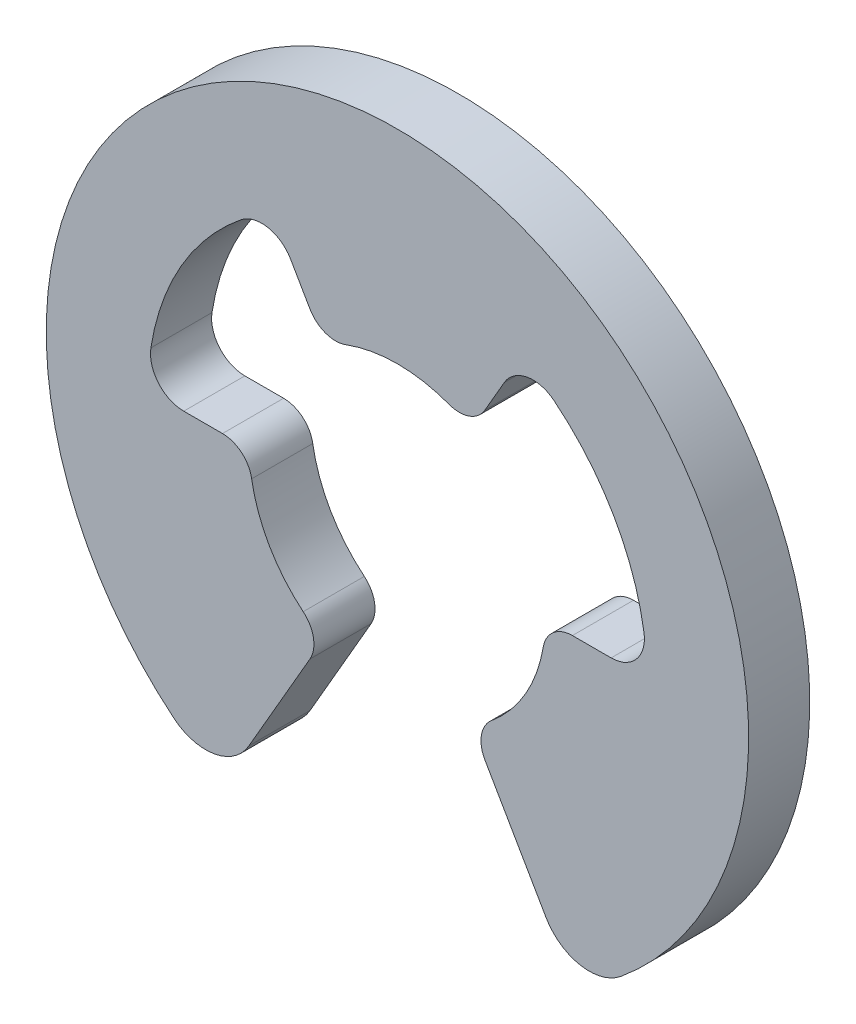
ISO-10303-21;
HEADER;
FILE_DESCRIPTION(('STEP AP214'),'2;1');
FILE_NAME('part.step','',(''),(''),'','','');
FILE_SCHEMA(('AUTOMOTIVE_DESIGN { 1 0 10303 214 1 1 1 1 }'));
ENDSEC;
DATA;
#1=APPLICATION_CONTEXT('core data for automotive mechanical design processes');
#2=APPLICATION_PROTOCOL_DEFINITION('international standard','automotive_design',2000,#1);
#3=PRODUCT_CONTEXT('',#1,'mechanical');
#4=PRODUCT('Part','Part','',(#3));
#5=PRODUCT_RELATED_PRODUCT_CATEGORY('part','',(#4));
#6=PRODUCT_DEFINITION_FORMATION('','',#4);
#7=PRODUCT_DEFINITION_CONTEXT('part definition',#1,'design');
#8=PRODUCT_DEFINITION('design','',#6,#7);
#9=PRODUCT_DEFINITION_SHAPE('','',#8);
#10=(LENGTH_UNIT() NAMED_UNIT(*) SI_UNIT(.MILLI.,.METRE.));
#11=(NAMED_UNIT(*) PLANE_ANGLE_UNIT() SI_UNIT($,.RADIAN.));
#12=(NAMED_UNIT(*) SI_UNIT($,.STERADIAN.) SOLID_ANGLE_UNIT());
#13=UNCERTAINTY_MEASURE_WITH_UNIT(LENGTH_MEASURE(1.E-05),#10,'distance_accuracy_value','');
#14=(GEOMETRIC_REPRESENTATION_CONTEXT(3) GLOBAL_UNCERTAINTY_ASSIGNED_CONTEXT((#13)) GLOBAL_UNIT_ASSIGNED_CONTEXT((#10,
#11,#12)) REPRESENTATION_CONTEXT('',''));
#15=CARTESIAN_POINT('',(0.,0.,0.));
#16=DIRECTION('',(0.,0.,1.));
#17=DIRECTION('',(1.,0.,0.));
#18=AXIS2_PLACEMENT_3D('',#15,#16,#17);
#19=CARTESIAN_POINT('',(3.4676526522127,-4.20148057663334,-0.55245));
#20=DIRECTION('',(0.,0.,1.));
#21=DIRECTION('',(1.,0.,0.));
#22=AXIS2_PLACEMENT_3D('',#19,#20,#21);
#23=PLANE('',#22);
#24=DIRECTION('',(-0.5,0.866025403784439,0.));
#25=VECTOR('',#24,1.);
#26=CARTESIAN_POINT('',(1.58157518881493,-2.73936858301781,-0.55245));
#27=LINE('',#26,#25);
#28=CARTESIAN_POINT('',(2.68620761948885,-4.65264807663335,-0.55245));
#29=VERTEX_POINT('',#28);
#30=CARTESIAN_POINT('',(1.58157518881493,-2.73936858301781,-0.55245));
#31=VERTEX_POINT('',#30);
#32=EDGE_CURVE('E178',#29,#31,#27,.T.);
#33=ORIENTED_EDGE('',*,*,#32,.T.);
#34=CARTESIAN_POINT('',(2.04461299145636,-2.47203358301781,-0.55245));
#35=DIRECTION('',(0.,0.,1.));
#36=DIRECTION('',(1.,0.,0.));
#37=AXIS2_PLACEMENT_3D('',#34,#35,#36);
#38=CIRCLE('',#37,0.53467);
#39=CARTESIAN_POINT('',(1.70384417243647,-2.0600279751873,-0.55245));
#40=VERTEX_POINT('',#39);
#41=EDGE_CURVE('E277',#40,#31,#38,.T.);
#42=ORIENTED_EDGE('',*,*,#41,.F.);
#43=CARTESIAN_POINT('',(0.,0.,-0.55245));
#44=DIRECTION('',(0.,0.,1.));
#45=DIRECTION('',(1.,0.,0.));
#46=AXIS2_PLACEMENT_3D('',#43,#44,#45);
#47=CIRCLE('',#46,2.67335);
#48=CARTESIAN_POINT('',(2.6359586471713,-0.445558338383286,-0.55245));
#49=VERTEX_POINT('',#48);
#50=EDGE_CURVE('E280',#40,#49,#47,.T.);
#51=ORIENTED_EDGE('',*,*,#50,.T.);
#52=CARTESIAN_POINT('',(3.16315037762987,-0.53467,-0.55245));
#53=DIRECTION('',(0.,0.,1.));
#54=DIRECTION('',(1.,0.,0.));
#55=AXIS2_PLACEMENT_3D('',#52,#53,#54);
#56=CIRCLE('',#55,0.53467);
#57=CARTESIAN_POINT('',(3.16315037762987,0.,-0.55245));
#58=VERTEX_POINT('',#57);
#59=EDGE_CURVE('E201',#58,#49,#56,.T.);
#60=ORIENTED_EDGE('',*,*,#59,.F.);
#61=DIRECTION('',(1.,0.,0.));
#62=VECTOR('',#61,1.);
#63=CARTESIAN_POINT('',(3.86356764628994,0.,-0.55245));
#64=LINE('',#63,#62);
#65=CARTESIAN_POINT('',(3.86356764628994,0.,-0.55245));
#66=VERTEX_POINT('',#65);
#67=EDGE_CURVE('E198',#58,#66,#64,.T.);
#68=ORIENTED_EDGE('',*,*,#67,.T.);
#69=CARTESIAN_POINT('',(3.86356764628994,0.601556666666666,-0.55245));
#70=DIRECTION('',(0.,0.,1.));
#71=DIRECTION('',(1.,0.,0.));
#72=AXIS2_PLACEMENT_3D('',#69,#70,#71);
#73=CIRCLE('',#72,0.601556666666666);
#74=CARTESIAN_POINT('',(4.45796266879608,0.694103846153846,-0.55245));
#75=VERTEX_POINT('',#74);
#76=EDGE_CURVE('E286',#66,#75,#73,.T.);
#77=ORIENTED_EDGE('',*,*,#76,.T.);
#78=CARTESIAN_POINT('',(0.,0.,-0.55245));
#79=DIRECTION('',(0.,0.,1.));
#80=DIRECTION('',(1.,0.,0.));
#81=AXIS2_PLACEMENT_3D('',#78,#79,#80);
#82=CIRCLE('',#81,4.511675);
#83=CARTESIAN_POINT('',(2.83009291463784,3.51365698384771,-0.55245));
#84=VERTEX_POINT('',#83);
#85=EDGE_CURVE('E290',#75,#84,#82,.T.);
#86=ORIENTED_EDGE('',*,*,#85,.T.);
#87=CARTESIAN_POINT('',(2.45274717829419,3.0451693975934,-0.55245));
#88=DIRECTION('',(0.,0.,1.));
#89=DIRECTION('',(1.,0.,0.));
#90=AXIS2_PLACEMENT_3D('',#87,#88,#89);
#91=CIRCLE('',#90,0.601556666666668);
#92=CARTESIAN_POINT('',(1.93178382314497,3.34594773092674,-0.55245));
#93=VERTEX_POINT('',#92);
#94=EDGE_CURVE('E294',#84,#93,#91,.T.);
#95=ORIENTED_EDGE('',*,*,#94,.T.);
#96=DIRECTION('',(-0.5,-0.866025403784439,0.));
#97=VECTOR('',#96,1.);
#98=CARTESIAN_POINT('',(1.58157518881494,2.73936858301781,-0.55245));
#99=LINE('',#98,#97);
#100=CARTESIAN_POINT('',(1.58157518881494,2.73936858301782,-0.55245));
#101=VERTEX_POINT('',#100);
#102=EDGE_CURVE('E203',#93,#101,#99,.T.);
#103=ORIENTED_EDGE('',*,*,#102,.T.);
#104=CARTESIAN_POINT('',(1.11853738617351,3.00670358301781,-0.55245));
#105=DIRECTION('',(0.,0.,1.));
#106=DIRECTION('',(1.,0.,0.));
#107=AXIS2_PLACEMENT_3D('',#104,#105,#106);
#108=CIRCLE('',#107,0.53467);
#109=CARTESIAN_POINT('',(0.932114472800587,2.50558632501371,-0.55245));
#110=VERTEX_POINT('',#109);
#111=EDGE_CURVE('E297',#110,#101,#108,.T.);
#112=ORIENTED_EDGE('',*,*,#111,.F.);
#113=CARTESIAN_POINT('',(0.,0.,-0.55245));
#114=DIRECTION('',(0.,0.,1.));
#115=DIRECTION('',(1.,0.,0.));
#116=AXIS2_PLACEMENT_3D('',#113,#114,#115);
#117=CIRCLE('',#116,2.67335);
#118=CARTESIAN_POINT('',(-0.932114488477924,2.50558631918151,-0.55245));
#119=VERTEX_POINT('',#118);
#120=EDGE_CURVE('E300',#110,#119,#117,.T.);
#121=ORIENTED_EDGE('',*,*,#120,.T.);
#122=CARTESIAN_POINT('',(-1.11853738617351,3.00670358301781,-0.55245));
#123=DIRECTION('',(0.,0.,1.));
#124=DIRECTION('',(1.,0.,0.));
#125=AXIS2_PLACEMENT_3D('',#122,#123,#124);
#126=CIRCLE('',#125,0.53467);
#127=CARTESIAN_POINT('',(-1.58157518881493,2.73936858301782,-0.55245));
#128=VERTEX_POINT('',#127);
#129=EDGE_CURVE('E211',#128,#119,#126,.T.);
#130=ORIENTED_EDGE('',*,*,#129,.F.);
#131=DIRECTION('',(-0.5,0.866025403784439,0.));
#132=VECTOR('',#131,1.);
#133=CARTESIAN_POINT('',(-1.93178382314496,3.34594773092674,-0.55245));
#134=LINE('',#133,#132);
#135=CARTESIAN_POINT('',(-1.93178382314496,3.34594773092674,-0.55245));
#136=VERTEX_POINT('',#135);
#137=EDGE_CURVE('E208',#128,#136,#134,.T.);
#138=ORIENTED_EDGE('',*,*,#137,.T.);
#139=CARTESIAN_POINT('',(-2.45274717829419,3.0451693975934,-0.55245));
#140=DIRECTION('',(0.,0.,1.));
#141=DIRECTION('',(1.,0.,0.));
#142=AXIS2_PLACEMENT_3D('',#139,#140,#141);
#143=CIRCLE('',#142,0.601556666666666);
#144=CARTESIAN_POINT('',(-2.83009289803176,3.51365699722315,-0.55245));
#145=VERTEX_POINT('',#144);
#146=EDGE_CURVE('E306',#136,#145,#143,.T.);
#147=ORIENTED_EDGE('',*,*,#146,.T.);
#148=CARTESIAN_POINT('',(0.,0.,-0.55245));
#149=DIRECTION('',(0.,0.,1.));
#150=DIRECTION('',(1.,0.,0.));
#151=AXIS2_PLACEMENT_3D('',#148,#149,#150);
#152=CIRCLE('',#151,4.511675);
#153=CARTESIAN_POINT('',(-4.45796266991038,0.694103838997061,-0.55245));
#154=VERTEX_POINT('',#153);
#155=EDGE_CURVE('E310',#145,#154,#152,.T.);
#156=ORIENTED_EDGE('',*,*,#155,.T.);
#157=CARTESIAN_POINT('',(-3.86356764628992,0.601556666666668,-0.55245));
#158=DIRECTION('',(0.,0.,1.));
#159=DIRECTION('',(1.,0.,0.));
#160=AXIS2_PLACEMENT_3D('',#157,#158,#159);
#161=CIRCLE('',#160,0.601556666666668);
#162=CARTESIAN_POINT('',(-3.86356764628993,0.,-0.55245));
#163=VERTEX_POINT('',#162);
#164=EDGE_CURVE('E314',#154,#163,#161,.T.);
#165=ORIENTED_EDGE('',*,*,#164,.T.);
#166=DIRECTION('',(1.,0.,0.));
#167=VECTOR('',#166,1.);
#168=CARTESIAN_POINT('',(-3.16315037762987,0.,-0.55245));
#169=LINE('',#168,#167);
#170=CARTESIAN_POINT('',(-3.16315037762987,0.,-0.55245));
#171=VERTEX_POINT('',#170);
#172=EDGE_CURVE('E213',#163,#171,#169,.T.);
#173=ORIENTED_EDGE('',*,*,#172,.T.);
#174=CARTESIAN_POINT('',(-3.16315037762987,-0.53467,-0.55245));
#175=DIRECTION('',(0.,0.,1.));
#176=DIRECTION('',(1.,0.,0.));
#177=AXIS2_PLACEMENT_3D('',#174,#175,#176);
#178=CIRCLE('',#177,0.53467);
#179=CARTESIAN_POINT('',(-2.63595864523706,-0.445558349826407,-0.55245));
#180=VERTEX_POINT('',#179);
#181=EDGE_CURVE('E317',#180,#171,#178,.T.);
#182=ORIENTED_EDGE('',*,*,#181,.F.);
#183=CARTESIAN_POINT('',(0.,0.,-0.55245));
#184=DIRECTION('',(0.,0.,1.));
#185=DIRECTION('',(1.,0.,0.));
#186=AXIS2_PLACEMENT_3D('',#183,#184,#185);
#187=CIRCLE('',#186,2.67335);
#188=CARTESIAN_POINT('',(-1.70384415560038,-2.06002798911239,-0.55245));
#189=VERTEX_POINT('',#188);
#190=EDGE_CURVE('E320',#180,#189,#187,.T.);
#191=ORIENTED_EDGE('',*,*,#190,.T.);
#192=CARTESIAN_POINT('',(-2.04461299145636,-2.47203358301781,-0.55245));
#193=DIRECTION('',(0.,0.,1.));
#194=DIRECTION('',(1.,0.,0.));
#195=AXIS2_PLACEMENT_3D('',#192,#193,#194);
#196=CIRCLE('',#195,0.53467);
#197=CARTESIAN_POINT('',(-1.58157518881494,-2.73936858301781,-0.55245));
#198=VERTEX_POINT('',#197);
#199=EDGE_CURVE('E221',#198,#189,#196,.T.);
#200=ORIENTED_EDGE('',*,*,#199,.F.);
#201=DIRECTION('',(-0.500000000000001,-0.866025403784438,0.));
#202=VECTOR('',#201,1.);
#203=CARTESIAN_POINT('',(-2.68620761948885,-4.65264807663334,-0.55245));
#204=LINE('',#203,#202);
#205=CARTESIAN_POINT('',(-2.68620761948885,-4.65264807663335,-0.55245));
#206=VERTEX_POINT('',#205);
#207=EDGE_CURVE('E218',#198,#206,#204,.T.);
#208=ORIENTED_EDGE('',*,*,#207,.T.);
#209=CARTESIAN_POINT('',(-3.4676526522127,-4.20148057663334,-0.55245));
#210=DIRECTION('',(0.,0.,1.));
#211=DIRECTION('',(1.,0.,0.));
#212=AXIS2_PLACEMENT_3D('',#209,#210,#211);
#213=CIRCLE('',#212,0.902335);
#214=CARTESIAN_POINT('',(-4.04202430611108,-4.89740130158917,-0.55245));
#215=VERTEX_POINT('',#214);
#216=EDGE_CURVE('E326',#215,#206,#213,.T.);
#217=ORIENTED_EDGE('',*,*,#216,.F.);
#218=CARTESIAN_POINT('',(0.,0.,-0.55245));
#219=DIRECTION('',(0.,0.,1.));
#220=DIRECTION('',(1.,0.,0.));
#221=AXIS2_PLACEMENT_3D('',#218,#219,#220);
#222=CIRCLE('',#221,6.35);
#223=CARTESIAN_POINT('',(4.0420243212384,-4.89740128910397,-0.55245));
#224=VERTEX_POINT('',#223);
#225=EDGE_CURVE('E180',#224,#215,#222,.T.);
#226=ORIENTED_EDGE('',*,*,#225,.F.);
#227=CARTESIAN_POINT('',(3.4676526522127,-4.20148057663334,-0.55245));
#228=DIRECTION('',(0.,0.,1.));
#229=DIRECTION('',(1.,0.,0.));
#230=AXIS2_PLACEMENT_3D('',#227,#228,#229);
#231=CIRCLE('',#230,0.902335);
#232=EDGE_CURVE('E20',#29,#224,#231,.T.);
#233=ORIENTED_EDGE('',*,*,#232,.F.);
#234=EDGE_LOOP('',(#33,#42,#51,#60,#68,#77,#86,#95,#103,#112,#121,#130,#138,#147,#156,#165,#173,
#182,#191,#200,#208,#217,#226,#233));
#235=FACE_BOUND('',#234,.T.);
#236=ADVANCED_FACE('F17',(#235),#23,.F.);
#237=CARTESIAN_POINT('',(3.4676526522127,-4.20148057663334,0.55245));
#238=DIRECTION('',(0.,0.,1.));
#239=DIRECTION('',(1.,0.,0.));
#240=AXIS2_PLACEMENT_3D('',#237,#238,#239);
#241=CYLINDRICAL_SURFACE('',#240,0.902335);
#242=CARTESIAN_POINT('',(3.4676526522127,-4.20148057663334,0.55245));
#243=DIRECTION('',(0.,0.,1.));
#244=DIRECTION('',(1.,0.,0.));
#245=AXIS2_PLACEMENT_3D('',#242,#243,#244);
#246=CIRCLE('',#245,0.902335);
#247=CARTESIAN_POINT('',(2.68620761948885,-4.65264807663335,0.55245));
#248=VERTEX_POINT('',#247);
#249=CARTESIAN_POINT('',(4.0420243212384,-4.89740128910397,0.55245));
#250=VERTEX_POINT('',#249);
#251=EDGE_CURVE('E187',#248,#250,#246,.T.);
#252=ORIENTED_EDGE('',*,*,#251,.F.);
#253=DIRECTION('',(0.,0.,1.));
#254=VECTOR('',#253,1.);
#255=CARTESIAN_POINT('',(2.68620761948885,-4.65264807663334,0.55245));
#256=LINE('',#255,#254);
#257=EDGE_CURVE('E184',#248,#29,#256,.F.);
#258=ORIENTED_EDGE('',*,*,#257,.T.);
#259=ORIENTED_EDGE('',*,*,#232,.T.);
#260=DIRECTION('',(0.,0.,1.));
#261=VECTOR('',#260,1.);
#262=CARTESIAN_POINT('',(4.04202433636572,-4.89740127661878,0.55245));
#263=LINE('',#262,#261);
#264=EDGE_CURVE('E196',#250,#224,#263,.F.);
#265=ORIENTED_EDGE('',*,*,#264,.F.);
#266=EDGE_LOOP('',(#252,#258,#259,#265));
#267=FACE_BOUND('',#266,.T.);
#268=ADVANCED_FACE('F185',(#267),#241,.T.);
#269=CARTESIAN_POINT('',(0.,0.,0.55245));
#270=DIRECTION('',(0.,0.,1.));
#271=DIRECTION('',(1.,0.,0.));
#272=AXIS2_PLACEMENT_3D('',#269,#270,#271);
#273=CYLINDRICAL_SURFACE('',#272,6.35);
#274=CARTESIAN_POINT('',(0.,0.,0.55245));
#275=DIRECTION('',(0.,0.,1.));
#276=DIRECTION('',(1.,0.,0.));
#277=AXIS2_PLACEMENT_3D('',#274,#275,#276);
#278=CIRCLE('',#277,6.35);
#279=CARTESIAN_POINT('',(-4.04202430611108,-4.89740130158917,0.55245));
#280=VERTEX_POINT('',#279);
#281=EDGE_CURVE('E192',#250,#280,#278,.T.);
#282=ORIENTED_EDGE('',*,*,#281,.F.);
#283=ORIENTED_EDGE('',*,*,#264,.T.);
#284=ORIENTED_EDGE('',*,*,#225,.T.);
#285=DIRECTION('',(0.,0.,1.));
#286=VECTOR('',#285,1.);
#287=CARTESIAN_POINT('',(-4.04202430611107,-4.89740130158917,0.55245));
#288=LINE('',#287,#286);
#289=EDGE_CURVE('E327',#280,#215,#288,.F.);
#290=ORIENTED_EDGE('',*,*,#289,.F.);
#291=EDGE_LOOP('',(#282,#283,#284,#290));
#292=FACE_BOUND('',#291,.T.);
#293=ADVANCED_FACE('F331',(#292),#273,.T.);
#294=CARTESIAN_POINT('',(-3.4676526522127,-4.20148057663334,0.55245));
#295=DIRECTION('',(0.,0.,1.));
#296=DIRECTION('',(1.,0.,0.));
#297=AXIS2_PLACEMENT_3D('',#294,#295,#296);
#298=CYLINDRICAL_SURFACE('',#297,0.902335);
#299=CARTESIAN_POINT('',(-3.4676526522127,-4.20148057663334,0.55245));
#300=DIRECTION('',(0.,0.,1.));
#301=DIRECTION('',(1.,0.,0.));
#302=AXIS2_PLACEMENT_3D('',#299,#300,#301);
#303=CIRCLE('',#302,0.902335);
#304=CARTESIAN_POINT('',(-2.68620761948885,-4.65264807663335,0.55245));
#305=VERTEX_POINT('',#304);
#306=EDGE_CURVE('E272',#280,#305,#303,.T.);
#307=ORIENTED_EDGE('',*,*,#306,.F.);
#308=ORIENTED_EDGE('',*,*,#289,.T.);
#309=ORIENTED_EDGE('',*,*,#216,.T.);
#310=DIRECTION('',(0.,0.,1.));
#311=VECTOR('',#310,1.);
#312=CARTESIAN_POINT('',(-2.68620761948885,-4.65264807663334,0.55245));
#313=LINE('',#312,#311);
#314=EDGE_CURVE('E222',#206,#305,#313,.T.);
#315=ORIENTED_EDGE('',*,*,#314,.T.);
#316=EDGE_LOOP('',(#307,#308,#309,#315));
#317=FACE_BOUND('',#316,.T.);
#318=ADVANCED_FACE('F367',(#317),#298,.T.);
#319=CARTESIAN_POINT('',(-2.68620761948885,-4.65264807663334,0.55245));
#320=DIRECTION('',(-0.866025403784438,0.500000000000001,0.));
#321=DIRECTION('',(-0.500000000000001,-0.866025403784438,0.));
#322=AXIS2_PLACEMENT_3D('',#319,#320,#321);
#323=PLANE('',#322);
#324=DIRECTION('',(0.,0.,1.));
#325=VECTOR('',#324,1.);
#326=CARTESIAN_POINT('',(-1.58157518881494,-2.73936858301781,0.55245));
#327=LINE('',#326,#325);
#328=CARTESIAN_POINT('',(-1.58157518881494,-2.73936858301781,0.55245));
#329=VERTEX_POINT('',#328);
#330=EDGE_CURVE('E325',#329,#198,#327,.F.);
#331=ORIENTED_EDGE('',*,*,#330,.F.);
#332=DIRECTION('',(0.499999999999999,0.866025403784439,0.));
#333=VECTOR('',#332,1.);
#334=CARTESIAN_POINT('',(-2.68620761948885,-4.65264807663334,0.55245));
#335=LINE('',#334,#333);
#336=EDGE_CURVE('E271',#305,#329,#335,.T.);
#337=ORIENTED_EDGE('',*,*,#336,.F.);
#338=ORIENTED_EDGE('',*,*,#314,.F.);
#339=ORIENTED_EDGE('',*,*,#207,.F.);
#340=EDGE_LOOP('',(#331,#337,#338,#339));
#341=FACE_BOUND('',#340,.T.);
#342=ADVANCED_FACE('F587',(#341),#323,.F.);
#343=CARTESIAN_POINT('',(-2.04461299145636,-2.47203358301781,0.55245));
#344=DIRECTION('',(0.,0.,1.));
#345=DIRECTION('',(1.,0.,0.));
#346=AXIS2_PLACEMENT_3D('',#343,#344,#345);
#347=CYLINDRICAL_SURFACE('',#346,0.53467);
#348=CARTESIAN_POINT('',(-2.04461299145636,-2.47203358301781,0.55245));
#349=DIRECTION('',(0.,0.,1.));
#350=DIRECTION('',(1.,0.,0.));
#351=AXIS2_PLACEMENT_3D('',#348,#349,#350);
#352=CIRCLE('',#351,0.53467);
#353=CARTESIAN_POINT('',(-1.70384415560038,-2.06002798911239,0.55245));
#354=VERTEX_POINT('',#353);
#355=EDGE_CURVE('E268',#329,#354,#352,.T.);
#356=ORIENTED_EDGE('',*,*,#355,.F.);
#357=ORIENTED_EDGE('',*,*,#330,.T.);
#358=ORIENTED_EDGE('',*,*,#199,.T.);
#359=DIRECTION('',(0.,0.,1.));
#360=VECTOR('',#359,1.);
#361=CARTESIAN_POINT('',(-1.70384415165379,-2.0600279923766,0.55245));
#362=LINE('',#361,#360);
#363=EDGE_CURVE('E323',#189,#354,#362,.T.);
#364=ORIENTED_EDGE('',*,*,#363,.T.);
#365=EDGE_LOOP('',(#356,#357,#358,#364));
#366=FACE_BOUND('',#365,.T.);
#367=ADVANCED_FACE('F577',(#366),#347,.T.);
#368=CARTESIAN_POINT('',(0.,0.,0.55245));
#369=DIRECTION('',(0.,0.,1.));
#370=DIRECTION('',(1.,0.,0.));
#371=AXIS2_PLACEMENT_3D('',#368,#369,#370);
#372=CYLINDRICAL_SURFACE('',#371,2.67335);
#373=DIRECTION('',(0.,0.,1.));
#374=VECTOR('',#373,1.);
#375=CARTESIAN_POINT('',(-2.63595864244922,-0.44555836631948,0.55245));
#376=LINE('',#375,#374);
#377=CARTESIAN_POINT('',(-2.63595864523706,-0.445558349826407,0.55245));
#378=VERTEX_POINT('',#377);
#379=EDGE_CURVE('E319',#378,#180,#376,.F.);
#380=ORIENTED_EDGE('',*,*,#379,.F.);
#381=CARTESIAN_POINT('',(0.,0.,0.55245));
#382=DIRECTION('',(0.,0.,1.));
#383=DIRECTION('',(1.,0.,0.));
#384=AXIS2_PLACEMENT_3D('',#381,#382,#383);
#385=CIRCLE('',#384,2.67335);
#386=EDGE_CURVE('E265',#354,#378,#385,.F.);
#387=ORIENTED_EDGE('',*,*,#386,.F.);
#388=ORIENTED_EDGE('',*,*,#363,.F.);
#389=ORIENTED_EDGE('',*,*,#190,.F.);
#390=EDGE_LOOP('',(#380,#387,#388,#389));
#391=FACE_BOUND('',#390,.T.);
#392=ADVANCED_FACE('F567',(#391),#372,.F.);
#393=CARTESIAN_POINT('',(-3.16315037762987,-0.53467,0.55245));
#394=DIRECTION('',(0.,0.,1.));
#395=DIRECTION('',(1.,0.,0.));
#396=AXIS2_PLACEMENT_3D('',#393,#394,#395);
#397=CYLINDRICAL_SURFACE('',#396,0.53467);
#398=CARTESIAN_POINT('',(-3.16315037762987,-0.53467,0.55245));
#399=DIRECTION('',(0.,0.,1.));
#400=DIRECTION('',(1.,0.,0.));
#401=AXIS2_PLACEMENT_3D('',#398,#399,#400);
#402=CIRCLE('',#401,0.53467);
#403=CARTESIAN_POINT('',(-3.16315037762987,0.,0.55245));
#404=VERTEX_POINT('',#403);
#405=EDGE_CURVE('E262',#378,#404,#402,.T.);
#406=ORIENTED_EDGE('',*,*,#405,.F.);
#407=ORIENTED_EDGE('',*,*,#379,.T.);
#408=ORIENTED_EDGE('',*,*,#181,.T.);
#409=DIRECTION('',(0.,0.,-1.));
#410=VECTOR('',#409,1.);
#411=CARTESIAN_POINT('',(-3.16315037762987,0.,0.55245));
#412=LINE('',#411,#410);
#413=EDGE_CURVE('E217',#171,#404,#412,.F.);
#414=ORIENTED_EDGE('',*,*,#413,.T.);
#415=EDGE_LOOP('',(#406,#407,#408,#414));
#416=FACE_BOUND('',#415,.T.);
#417=ADVANCED_FACE('F557',(#416),#397,.T.);
#418=CARTESIAN_POINT('',(-3.16315037762987,0.,0.55245));
#419=DIRECTION('',(0.,-1.,0.));
#420=DIRECTION('',(0.,0.,-1.));
#421=AXIS2_PLACEMENT_3D('',#418,#419,#420);
#422=PLANE('',#421);
#423=DIRECTION('',(0.,0.,1.));
#424=VECTOR('',#423,1.);
#425=CARTESIAN_POINT('',(-3.86356764628994,0.,0.55245));
#426=LINE('',#425,#424);
#427=CARTESIAN_POINT('',(-3.86356764628993,0.,0.55245));
#428=VERTEX_POINT('',#427);
#429=EDGE_CURVE('E216',#163,#428,#426,.T.);
#430=ORIENTED_EDGE('',*,*,#429,.T.);
#431=DIRECTION('',(1.,0.,0.));
#432=VECTOR('',#431,1.);
#433=CARTESIAN_POINT('',(3.4676526522127,0.,0.55245));
#434=LINE('',#433,#432);
#435=EDGE_CURVE('E261',#404,#428,#434,.F.);
#436=ORIENTED_EDGE('',*,*,#435,.F.);
#437=ORIENTED_EDGE('',*,*,#413,.F.);
#438=ORIENTED_EDGE('',*,*,#172,.F.);
#439=EDGE_LOOP('',(#430,#436,#437,#438));
#440=FACE_BOUND('',#439,.T.);
#441=ADVANCED_FACE('F547',(#440),#422,.F.);
#442=CARTESIAN_POINT('',(-3.86356764628992,0.601556666666668,0.55245));
#443=DIRECTION('',(0.,0.,1.));
#444=DIRECTION('',(1.,0.,0.));
#445=AXIS2_PLACEMENT_3D('',#442,#443,#444);
#446=CYLINDRICAL_SURFACE('',#445,0.601556666666668);
#447=DIRECTION('',(0.,0.,1.));
#448=VECTOR('',#447,1.);
#449=CARTESIAN_POINT('',(-4.4579626710247,0.694103831840273,0.55245));
#450=LINE('',#449,#448);
#451=CARTESIAN_POINT('',(-4.45796266991039,0.694103838997062,0.55245));
#452=VERTEX_POINT('',#451);
#453=EDGE_CURVE('E313',#154,#452,#450,.T.);
#454=ORIENTED_EDGE('',*,*,#453,.T.);
#455=CARTESIAN_POINT('',(-3.86356764628992,0.601556666666668,0.55245));
#456=DIRECTION('',(0.,0.,1.));
#457=DIRECTION('',(1.,0.,0.));
#458=AXIS2_PLACEMENT_3D('',#455,#456,#457);
#459=CIRCLE('',#458,0.601556666666668);
#460=EDGE_CURVE('E258',#428,#452,#459,.F.);
#461=ORIENTED_EDGE('',*,*,#460,.F.);
#462=ORIENTED_EDGE('',*,*,#429,.F.);
#463=ORIENTED_EDGE('',*,*,#164,.F.);
#464=EDGE_LOOP('',(#454,#461,#462,#463));
#465=FACE_BOUND('',#464,.T.);
#466=ADVANCED_FACE('F537',(#465),#446,.F.);
#467=CARTESIAN_POINT('',(0.,0.,0.55245));
#468=DIRECTION('',(0.,0.,1.));
#469=DIRECTION('',(1.,0.,0.));
#470=AXIS2_PLACEMENT_3D('',#467,#468,#469);
#471=CYLINDRICAL_SURFACE('',#470,4.511675);
#472=DIRECTION('',(0.,0.,1.));
#473=VECTOR('',#472,1.);
#474=CARTESIAN_POINT('',(-2.83009289803176,3.51365699722315,0.55245));
#475=LINE('',#474,#473);
#476=CARTESIAN_POINT('',(-2.83009289803175,3.51365699722315,0.55245));
#477=VERTEX_POINT('',#476);
#478=EDGE_CURVE('E309',#145,#477,#475,.T.);
#479=ORIENTED_EDGE('',*,*,#478,.T.);
#480=CARTESIAN_POINT('',(0.,0.,0.55245));
#481=DIRECTION('',(0.,0.,1.));
#482=DIRECTION('',(1.,0.,0.));
#483=AXIS2_PLACEMENT_3D('',#480,#481,#482);
#484=CIRCLE('',#483,4.511675);
#485=EDGE_CURVE('E255',#452,#477,#484,.F.);
#486=ORIENTED_EDGE('',*,*,#485,.F.);
#487=ORIENTED_EDGE('',*,*,#453,.F.);
#488=ORIENTED_EDGE('',*,*,#155,.F.);
#489=EDGE_LOOP('',(#479,#486,#487,#488));
#490=FACE_BOUND('',#489,.T.);
#491=ADVANCED_FACE('F527',(#490),#471,.F.);
#492=CARTESIAN_POINT('',(-2.45274717829419,3.0451693975934,0.55245));
#493=DIRECTION('',(0.,0.,1.));
#494=DIRECTION('',(1.,0.,0.));
#495=AXIS2_PLACEMENT_3D('',#492,#493,#494);
#496=CYLINDRICAL_SURFACE('',#495,0.601556666666666);
#497=DIRECTION('',(0.,0.,1.));
#498=VECTOR('',#497,1.);
#499=CARTESIAN_POINT('',(-1.93178382314496,3.34594773092674,0.55245));
#500=LINE('',#499,#498);
#501=CARTESIAN_POINT('',(-1.93178382314496,3.34594773092674,0.55245));
#502=VERTEX_POINT('',#501);
#503=EDGE_CURVE('E212',#136,#502,#500,.T.);
#504=ORIENTED_EDGE('',*,*,#503,.T.);
#505=CARTESIAN_POINT('',(-2.45274717829419,3.0451693975934,0.55245));
#506=DIRECTION('',(0.,0.,1.));
#507=DIRECTION('',(1.,0.,0.));
#508=AXIS2_PLACEMENT_3D('',#505,#506,#507);
#509=CIRCLE('',#508,0.601556666666666);
#510=EDGE_CURVE('E252',#477,#502,#509,.F.);
#511=ORIENTED_EDGE('',*,*,#510,.F.);
#512=ORIENTED_EDGE('',*,*,#478,.F.);
#513=ORIENTED_EDGE('',*,*,#146,.F.);
#514=EDGE_LOOP('',(#504,#511,#512,#513));
#515=FACE_BOUND('',#514,.T.);
#516=ADVANCED_FACE('F517',(#515),#496,.F.);
#517=CARTESIAN_POINT('',(-1.93178382314496,3.34594773092674,0.55245));
#518=DIRECTION('',(0.866025403784439,0.5,0.));
#519=DIRECTION('',(-0.5,0.866025403784439,0.));
#520=AXIS2_PLACEMENT_3D('',#517,#518,#519);
#521=PLANE('',#520);
#522=DIRECTION('',(0.,0.,1.));
#523=VECTOR('',#522,1.);
#524=CARTESIAN_POINT('',(-1.58157518881493,2.73936858301781,0.55245));
#525=LINE('',#524,#523);
#526=CARTESIAN_POINT('',(-1.58157518881493,2.73936858301782,0.55245));
#527=VERTEX_POINT('',#526);
#528=EDGE_CURVE('E305',#527,#128,#525,.F.);
#529=ORIENTED_EDGE('',*,*,#528,.F.);
#530=DIRECTION('',(0.499999999999997,-0.86602540378444,0.));
#531=VECTOR('',#530,1.);
#532=CARTESIAN_POINT('',(-1.93178382314496,3.34594773092674,0.55245));
#533=LINE('',#532,#531);
#534=EDGE_CURVE('E251',#502,#527,#533,.T.);
#535=ORIENTED_EDGE('',*,*,#534,.F.);
#536=ORIENTED_EDGE('',*,*,#503,.F.);
#537=ORIENTED_EDGE('',*,*,#137,.F.);
#538=EDGE_LOOP('',(#529,#535,#536,#537));
#539=FACE_BOUND('',#538,.T.);
#540=ADVANCED_FACE('F507',(#539),#521,.F.);
#541=CARTESIAN_POINT('',(-1.11853738617351,3.00670358301781,0.55245));
#542=DIRECTION('',(0.,0.,1.));
#543=DIRECTION('',(1.,0.,0.));
#544=AXIS2_PLACEMENT_3D('',#541,#542,#543);
#545=CYLINDRICAL_SURFACE('',#544,0.53467);
#546=CARTESIAN_POINT('',(-1.11853738617351,3.00670358301781,0.55245));
#547=DIRECTION('',(0.,0.,1.));
#548=DIRECTION('',(1.,0.,0.));
#549=AXIS2_PLACEMENT_3D('',#546,#547,#548);
#550=CIRCLE('',#549,0.53467);
#551=CARTESIAN_POINT('',(-0.932114488477923,2.50558631918151,0.55245));
#552=VERTEX_POINT('',#551);
#553=EDGE_CURVE('E248',#527,#552,#550,.T.);
#554=ORIENTED_EDGE('',*,*,#553,.F.);
#555=ORIENTED_EDGE('',*,*,#528,.T.);
#556=ORIENTED_EDGE('',*,*,#129,.T.);
#557=DIRECTION('',(0.,0.,1.));
#558=VECTOR('',#557,1.);
#559=CARTESIAN_POINT('',(-0.932114488477923,2.50558631918151,0.55245));
#560=LINE('',#559,#558);
#561=EDGE_CURVE('E303',#119,#552,#560,.T.);
#562=ORIENTED_EDGE('',*,*,#561,.T.);
#563=EDGE_LOOP('',(#554,#555,#556,#562));
#564=FACE_BOUND('',#563,.T.);
#565=ADVANCED_FACE('F497',(#564),#545,.T.);
#566=CARTESIAN_POINT('',(0.,0.,0.55245));
#567=DIRECTION('',(0.,0.,1.));
#568=DIRECTION('',(1.,0.,0.));
#569=AXIS2_PLACEMENT_3D('',#566,#567,#568);
#570=CYLINDRICAL_SURFACE('',#569,2.67335);
#571=DIRECTION('',(0.,0.,1.));
#572=VECTOR('',#571,1.);
#573=CARTESIAN_POINT('',(0.932114457123248,2.50558633084591,0.55245));
#574=LINE('',#573,#572);
#575=CARTESIAN_POINT('',(0.932114472800587,2.50558632501371,0.55245));
#576=VERTEX_POINT('',#575);
#577=EDGE_CURVE('E299',#576,#110,#574,.F.);
#578=ORIENTED_EDGE('',*,*,#577,.F.);
#579=CARTESIAN_POINT('',(0.,0.,0.55245));
#580=DIRECTION('',(0.,0.,1.));
#581=DIRECTION('',(1.,0.,0.));
#582=AXIS2_PLACEMENT_3D('',#579,#580,#581);
#583=CIRCLE('',#582,2.67335);
#584=EDGE_CURVE('E245',#552,#576,#583,.F.);
#585=ORIENTED_EDGE('',*,*,#584,.F.);
#586=ORIENTED_EDGE('',*,*,#561,.F.);
#587=ORIENTED_EDGE('',*,*,#120,.F.);
#588=EDGE_LOOP('',(#578,#585,#586,#587));
#589=FACE_BOUND('',#588,.T.);
#590=ADVANCED_FACE('F487',(#589),#570,.F.);
#591=CARTESIAN_POINT('',(1.11853738617351,3.00670358301781,0.55245));
#592=DIRECTION('',(0.,0.,1.));
#593=DIRECTION('',(1.,0.,0.));
#594=AXIS2_PLACEMENT_3D('',#591,#592,#593);
#595=CYLINDRICAL_SURFACE('',#594,0.53467);
#596=CARTESIAN_POINT('',(1.11853738617351,3.00670358301781,0.55245));
#597=DIRECTION('',(0.,0.,1.));
#598=DIRECTION('',(1.,0.,0.));
#599=AXIS2_PLACEMENT_3D('',#596,#597,#598);
#600=CIRCLE('',#599,0.53467);
#601=CARTESIAN_POINT('',(1.58157518881494,2.73936858301781,0.55245));
#602=VERTEX_POINT('',#601);
#603=EDGE_CURVE('E242',#576,#602,#600,.T.);
#604=ORIENTED_EDGE('',*,*,#603,.F.);
#605=ORIENTED_EDGE('',*,*,#577,.T.);
#606=ORIENTED_EDGE('',*,*,#111,.T.);
#607=DIRECTION('',(0.,0.,1.));
#608=VECTOR('',#607,1.);
#609=CARTESIAN_POINT('',(1.58157518881494,2.73936858301781,0.55245));
#610=LINE('',#609,#608);
#611=EDGE_CURVE('E207',#101,#602,#610,.T.);
#612=ORIENTED_EDGE('',*,*,#611,.T.);
#613=EDGE_LOOP('',(#604,#605,#606,#612));
#614=FACE_BOUND('',#613,.T.);
#615=ADVANCED_FACE('F477',(#614),#595,.T.);
#616=CARTESIAN_POINT('',(1.58157518881494,2.73936858301781,0.55245));
#617=DIRECTION('',(-0.866025403784439,0.5,0.));
#618=DIRECTION('',(-0.5,-0.866025403784439,0.));
#619=AXIS2_PLACEMENT_3D('',#616,#617,#618);
#620=PLANE('',#619);
#621=DIRECTION('',(0.,0.,1.));
#622=VECTOR('',#621,1.);
#623=CARTESIAN_POINT('',(1.93178382314497,3.34594773092674,0.55245));
#624=LINE('',#623,#622);
#625=CARTESIAN_POINT('',(1.93178382314497,3.34594773092674,0.55245));
#626=VERTEX_POINT('',#625);
#627=EDGE_CURVE('E206',#93,#626,#624,.T.);
#628=ORIENTED_EDGE('',*,*,#627,.T.);
#629=DIRECTION('',(0.5,0.866025403784438,0.));
#630=VECTOR('',#629,1.);
#631=CARTESIAN_POINT('',(1.58157518881494,2.73936858301781,0.55245));
#632=LINE('',#631,#630);
#633=EDGE_CURVE('E241',#602,#626,#632,.T.);
#634=ORIENTED_EDGE('',*,*,#633,.F.);
#635=ORIENTED_EDGE('',*,*,#611,.F.);
#636=ORIENTED_EDGE('',*,*,#102,.F.);
#637=EDGE_LOOP('',(#628,#634,#635,#636));
#638=FACE_BOUND('',#637,.T.);
#639=ADVANCED_FACE('F467',(#638),#620,.F.);
#640=CARTESIAN_POINT('',(2.45274717829419,3.0451693975934,0.55245));
#641=DIRECTION('',(0.,0.,1.));
#642=DIRECTION('',(1.,0.,0.));
#643=AXIS2_PLACEMENT_3D('',#640,#641,#642);
#644=CYLINDRICAL_SURFACE('',#643,0.601556666666668);
#645=DIRECTION('',(0.,0.,1.));
#646=VECTOR('',#645,1.);
#647=CARTESIAN_POINT('',(2.83009293124391,3.51365697047226,0.55245));
#648=LINE('',#647,#646);
#649=CARTESIAN_POINT('',(2.83009291463784,3.51365698384771,0.55245));
#650=VERTEX_POINT('',#649);
#651=EDGE_CURVE('E293',#84,#650,#648,.T.);
#652=ORIENTED_EDGE('',*,*,#651,.T.);
#653=CARTESIAN_POINT('',(2.45274717829419,3.0451693975934,0.55245));
#654=DIRECTION('',(0.,0.,1.));
#655=DIRECTION('',(1.,0.,0.));
#656=AXIS2_PLACEMENT_3D('',#653,#654,#655);
#657=CIRCLE('',#656,0.601556666666668);
#658=EDGE_CURVE('E238',#626,#650,#657,.F.);
#659=ORIENTED_EDGE('',*,*,#658,.F.);
#660=ORIENTED_EDGE('',*,*,#627,.F.);
#661=ORIENTED_EDGE('',*,*,#94,.F.);
#662=EDGE_LOOP('',(#652,#659,#660,#661));
#663=FACE_BOUND('',#662,.T.);
#664=ADVANCED_FACE('F457',(#663),#644,.F.);
#665=CARTESIAN_POINT('',(0.,0.,0.55245));
#666=DIRECTION('',(0.,0.,1.));
#667=DIRECTION('',(1.,0.,0.));
#668=AXIS2_PLACEMENT_3D('',#665,#666,#667);
#669=CYLINDRICAL_SURFACE('',#668,4.511675);
#670=DIRECTION('',(0.,0.,1.));
#671=VECTOR('',#670,1.);
#672=CARTESIAN_POINT('',(4.45796266879609,0.694103846153849,0.55245));
#673=LINE('',#672,#671);
#674=CARTESIAN_POINT('',(4.45796266879609,0.694103846153847,0.55245));
#675=VERTEX_POINT('',#674);
#676=EDGE_CURVE('E289',#75,#675,#673,.T.);
#677=ORIENTED_EDGE('',*,*,#676,.T.);
#678=CARTESIAN_POINT('',(0.,0.,0.55245));
#679=DIRECTION('',(0.,0.,1.));
#680=DIRECTION('',(1.,0.,0.));
#681=AXIS2_PLACEMENT_3D('',#678,#679,#680);
#682=CIRCLE('',#681,4.511675);
#683=EDGE_CURVE('E235',#650,#675,#682,.F.);
#684=ORIENTED_EDGE('',*,*,#683,.F.);
#685=ORIENTED_EDGE('',*,*,#651,.F.);
#686=ORIENTED_EDGE('',*,*,#85,.F.);
#687=EDGE_LOOP('',(#677,#684,#685,#686));
#688=FACE_BOUND('',#687,.T.);
#689=ADVANCED_FACE('F447',(#688),#669,.F.);
#690=CARTESIAN_POINT('',(3.86356764628994,0.601556666666666,0.55245));
#691=DIRECTION('',(0.,0.,1.));
#692=DIRECTION('',(1.,0.,0.));
#693=AXIS2_PLACEMENT_3D('',#690,#691,#692);
#694=CYLINDRICAL_SURFACE('',#693,0.601556666666666);
#695=DIRECTION('',(0.,0.,-1.));
#696=VECTOR('',#695,1.);
#697=CARTESIAN_POINT('',(3.86356764628994,0.,0.55245));
#698=LINE('',#697,#696);
#699=CARTESIAN_POINT('',(3.86356764628994,0.,0.55245));
#700=VERTEX_POINT('',#699);
#701=EDGE_CURVE('E202',#66,#700,#698,.F.);
#702=ORIENTED_EDGE('',*,*,#701,.T.);
#703=CARTESIAN_POINT('',(3.86356764628994,0.601556666666666,0.55245));
#704=DIRECTION('',(0.,0.,1.));
#705=DIRECTION('',(1.,0.,0.));
#706=AXIS2_PLACEMENT_3D('',#703,#704,#705);
#707=CIRCLE('',#706,0.601556666666666);
#708=EDGE_CURVE('E232',#675,#700,#707,.F.);
#709=ORIENTED_EDGE('',*,*,#708,.F.);
#710=ORIENTED_EDGE('',*,*,#676,.F.);
#711=ORIENTED_EDGE('',*,*,#76,.F.);
#712=EDGE_LOOP('',(#702,#709,#710,#711));
#713=FACE_BOUND('',#712,.T.);
#714=ADVANCED_FACE('F438',(#713),#694,.F.);
#715=CARTESIAN_POINT('',(3.86356764628994,0.,0.55245));
#716=DIRECTION('',(0.,-1.,0.));
#717=DIRECTION('',(0.,0.,-1.));
#718=AXIS2_PLACEMENT_3D('',#715,#716,#717);
#719=PLANE('',#718);
#720=DIRECTION('',(0.,0.,1.));
#721=VECTOR('',#720,1.);
#722=CARTESIAN_POINT('',(3.16315037762987,0.,0.55245));
#723=LINE('',#722,#721);
#724=CARTESIAN_POINT('',(3.16315037762987,0.,0.55245));
#725=VERTEX_POINT('',#724);
#726=EDGE_CURVE('E285',#725,#58,#723,.F.);
#727=ORIENTED_EDGE('',*,*,#726,.F.);
#728=DIRECTION('',(1.,0.,0.));
#729=VECTOR('',#728,1.);
#730=CARTESIAN_POINT('',(3.4676526522127,0.,0.55245));
#731=LINE('',#730,#729);
#732=EDGE_CURVE('E231',#700,#725,#731,.F.);
#733=ORIENTED_EDGE('',*,*,#732,.F.);
#734=ORIENTED_EDGE('',*,*,#701,.F.);
#735=ORIENTED_EDGE('',*,*,#67,.F.);
#736=EDGE_LOOP('',(#727,#733,#734,#735));
#737=FACE_BOUND('',#736,.T.);
#738=ADVANCED_FACE('F387',(#737),#719,.F.);
#739=CARTESIAN_POINT('',(3.16315037762987,-0.53467,0.55245));
#740=DIRECTION('',(0.,0.,1.));
#741=DIRECTION('',(1.,0.,0.));
#742=AXIS2_PLACEMENT_3D('',#739,#740,#741);
#743=CYLINDRICAL_SURFACE('',#742,0.53467);
#744=CARTESIAN_POINT('',(3.16315037762987,-0.53467,0.55245));
#745=DIRECTION('',(0.,0.,1.));
#746=DIRECTION('',(1.,0.,0.));
#747=AXIS2_PLACEMENT_3D('',#744,#745,#746);
#748=CIRCLE('',#747,0.53467);
#749=CARTESIAN_POINT('',(2.6359586471713,-0.445558338383286,0.55245));
#750=VERTEX_POINT('',#749);
#751=EDGE_CURVE('E228',#725,#750,#748,.T.);
#752=ORIENTED_EDGE('',*,*,#751,.F.);
#753=ORIENTED_EDGE('',*,*,#726,.T.);
#754=ORIENTED_EDGE('',*,*,#59,.T.);
#755=DIRECTION('',(0.,0.,1.));
#756=VECTOR('',#755,1.);
#757=CARTESIAN_POINT('',(2.6359586463177,-0.445558343433238,0.55245));
#758=LINE('',#757,#756);
#759=EDGE_CURVE('E283',#49,#750,#758,.T.);
#760=ORIENTED_EDGE('',*,*,#759,.T.);
#761=EDGE_LOOP('',(#752,#753,#754,#760));
#762=FACE_BOUND('',#761,.T.);
#763=ADVANCED_FACE('F390',(#762),#743,.T.);
#764=CARTESIAN_POINT('',(0.,0.,0.55245));
#765=DIRECTION('',(0.,0.,1.));
#766=DIRECTION('',(1.,0.,0.));
#767=AXIS2_PLACEMENT_3D('',#764,#765,#766);
#768=CYLINDRICAL_SURFACE('',#767,2.67335);
#769=DIRECTION('',(0.,0.,1.));
#770=VECTOR('',#769,1.);
#771=CARTESIAN_POINT('',(1.70384418532597,-2.06002796452642,0.55245));
#772=LINE('',#771,#770);
#773=CARTESIAN_POINT('',(1.70384417243647,-2.0600279751873,0.55245));
#774=VERTEX_POINT('',#773);
#775=EDGE_CURVE('E279',#774,#40,#772,.F.);
#776=ORIENTED_EDGE('',*,*,#775,.F.);
#777=CARTESIAN_POINT('',(0.,0.,0.55245));
#778=DIRECTION('',(0.,0.,1.));
#779=DIRECTION('',(1.,0.,0.));
#780=AXIS2_PLACEMENT_3D('',#777,#778,#779);
#781=CIRCLE('',#780,2.67335);
#782=EDGE_CURVE('E225',#750,#774,#781,.F.);
#783=ORIENTED_EDGE('',*,*,#782,.F.);
#784=ORIENTED_EDGE('',*,*,#759,.F.);
#785=ORIENTED_EDGE('',*,*,#50,.F.);
#786=EDGE_LOOP('',(#776,#783,#784,#785));
#787=FACE_BOUND('',#786,.T.);
#788=ADVANCED_FACE('F392',(#787),#768,.F.);
#789=CARTESIAN_POINT('',(2.04461299145636,-2.47203358301781,0.55245));
#790=DIRECTION('',(0.,0.,1.));
#791=DIRECTION('',(1.,0.,0.));
#792=AXIS2_PLACEMENT_3D('',#789,#790,#791);
#793=CYLINDRICAL_SURFACE('',#792,0.53467);
#794=CARTESIAN_POINT('',(2.04461299145636,-2.47203358301781,0.55245));
#795=DIRECTION('',(0.,0.,1.));
#796=DIRECTION('',(1.,0.,0.));
#797=AXIS2_PLACEMENT_3D('',#794,#795,#796);
#798=CIRCLE('',#797,0.53467);
#799=CARTESIAN_POINT('',(1.58157518881493,-2.73936858301781,0.55245));
#800=VERTEX_POINT('',#799);
#801=EDGE_CURVE('E26',#774,#800,#798,.T.);
#802=ORIENTED_EDGE('',*,*,#801,.F.);
#803=ORIENTED_EDGE('',*,*,#775,.T.);
#804=ORIENTED_EDGE('',*,*,#41,.T.);
#805=DIRECTION('',(0.,0.,1.));
#806=VECTOR('',#805,1.);
#807=CARTESIAN_POINT('',(1.58157518881493,-2.73936858301781,0.55245));
#808=LINE('',#807,#806);
#809=EDGE_CURVE('E35',#31,#800,#808,.T.);
#810=ORIENTED_EDGE('',*,*,#809,.T.);
#811=EDGE_LOOP('',(#802,#803,#804,#810));
#812=FACE_BOUND('',#811,.T.);
#813=ADVANCED_FACE('F337',(#812),#793,.T.);
#814=CARTESIAN_POINT('',(1.58157518881493,-2.73936858301781,0.55245));
#815=DIRECTION('',(0.866025403784439,0.5,0.));
#816=DIRECTION('',(-0.5,0.866025403784439,0.));
#817=AXIS2_PLACEMENT_3D('',#814,#815,#816);
#818=PLANE('',#817);
#819=ORIENTED_EDGE('',*,*,#257,.F.);
#820=DIRECTION('',(0.5,-0.866025403784439,0.));
#821=VECTOR('',#820,1.);
#822=CARTESIAN_POINT('',(1.58157518881493,-2.73936858301781,0.55245));
#823=LINE('',#822,#821);
#824=EDGE_CURVE('E11',#800,#248,#823,.T.);
#825=ORIENTED_EDGE('',*,*,#824,.F.);
#826=ORIENTED_EDGE('',*,*,#809,.F.);
#827=ORIENTED_EDGE('',*,*,#32,.F.);
#828=EDGE_LOOP('',(#819,#825,#826,#827));
#829=FACE_BOUND('',#828,.T.);
#830=ADVANCED_FACE('F190',(#829),#818,.F.);
#831=CARTESIAN_POINT('',(3.4676526522127,-4.20148057663334,0.55245));
#832=DIRECTION('',(0.,0.,1.));
#833=DIRECTION('',(1.,0.,0.));
#834=AXIS2_PLACEMENT_3D('',#831,#832,#833);
#835=PLANE('',#834);
#836=ORIENTED_EDGE('',*,*,#801,.T.);
#837=ORIENTED_EDGE('',*,*,#824,.T.);
#838=ORIENTED_EDGE('',*,*,#251,.T.);
#839=ORIENTED_EDGE('',*,*,#281,.T.);
#840=ORIENTED_EDGE('',*,*,#306,.T.);
#841=ORIENTED_EDGE('',*,*,#336,.T.);
#842=ORIENTED_EDGE('',*,*,#355,.T.);
#843=ORIENTED_EDGE('',*,*,#386,.T.);
#844=ORIENTED_EDGE('',*,*,#405,.T.);
#845=ORIENTED_EDGE('',*,*,#435,.T.);
#846=ORIENTED_EDGE('',*,*,#460,.T.);
#847=ORIENTED_EDGE('',*,*,#485,.T.);
#848=ORIENTED_EDGE('',*,*,#510,.T.);
#849=ORIENTED_EDGE('',*,*,#534,.T.);
#850=ORIENTED_EDGE('',*,*,#553,.T.);
#851=ORIENTED_EDGE('',*,*,#584,.T.);
#852=ORIENTED_EDGE('',*,*,#603,.T.);
#853=ORIENTED_EDGE('',*,*,#633,.T.);
#854=ORIENTED_EDGE('',*,*,#658,.T.);
#855=ORIENTED_EDGE('',*,*,#683,.T.);
#856=ORIENTED_EDGE('',*,*,#708,.T.);
#857=ORIENTED_EDGE('',*,*,#732,.T.);
#858=ORIENTED_EDGE('',*,*,#751,.T.);
#859=ORIENTED_EDGE('',*,*,#782,.T.);
#860=EDGE_LOOP('',(#836,#837,#838,#839,#840,#841,#842,#843,#844,#845,#846,#847,#848,#849,#850,
#851,#852,#853,#854,#855,#856,#857,#858,#859));
#861=FACE_BOUND('',#860,.T.);
#862=ADVANCED_FACE('F334',(#861),#835,.T.);
#863=CLOSED_SHELL('',(#236,#268,#293,#318,#342,#367,#392,#417,#441,#466,#491,#516,#540,#565,
#590,#615,#639,#664,#689,#714,#738,#763,#788,#813,#830,#862));
#864=MANIFOLD_SOLID_BREP('B1',#863);
#865=ADVANCED_BREP_SHAPE_REPRESENTATION('',(#18,#864),#14);
#866=SHAPE_DEFINITION_REPRESENTATION(#9,#865);
ENDSEC;
END-ISO-10303-21;
